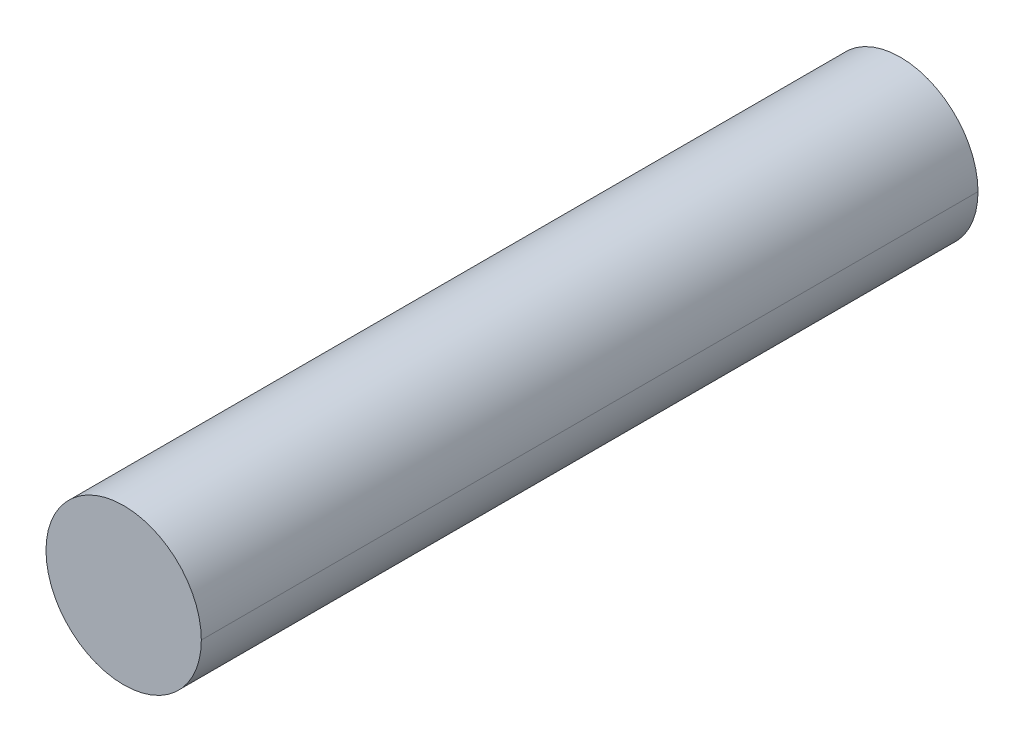
ISO-10303-21;
HEADER;
FILE_DESCRIPTION(('STEP AP214'),'2;1');
FILE_NAME('part.step','',(''),(''),'','','');
FILE_SCHEMA(('AUTOMOTIVE_DESIGN { 1 0 10303 214 1 1 1 1 }'));
ENDSEC;
DATA;
#1=APPLICATION_CONTEXT('core data for automotive mechanical design processes');
#2=APPLICATION_PROTOCOL_DEFINITION('international standard','automotive_design',2000,#1);
#3=PRODUCT_CONTEXT('',#1,'mechanical');
#4=PRODUCT('Part','Part','',(#3));
#5=PRODUCT_RELATED_PRODUCT_CATEGORY('part','',(#4));
#6=PRODUCT_DEFINITION_FORMATION('','',#4);
#7=PRODUCT_DEFINITION_CONTEXT('part definition',#1,'design');
#8=PRODUCT_DEFINITION('design','',#6,#7);
#9=PRODUCT_DEFINITION_SHAPE('','',#8);
#10=(LENGTH_UNIT() NAMED_UNIT(*) SI_UNIT(.MILLI.,.METRE.));
#11=(NAMED_UNIT(*) PLANE_ANGLE_UNIT() SI_UNIT($,.RADIAN.));
#12=(NAMED_UNIT(*) SI_UNIT($,.STERADIAN.) SOLID_ANGLE_UNIT());
#13=UNCERTAINTY_MEASURE_WITH_UNIT(LENGTH_MEASURE(1.E-05),#10,'distance_accuracy_value','');
#14=(GEOMETRIC_REPRESENTATION_CONTEXT(3) GLOBAL_UNCERTAINTY_ASSIGNED_CONTEXT((#13)) GLOBAL_UNIT_ASSIGNED_CONTEXT((#10,
#11,#12)) REPRESENTATION_CONTEXT('',''));
#15=CARTESIAN_POINT('',(0.,0.,0.));
#16=DIRECTION('',(0.,0.,1.));
#17=DIRECTION('',(1.,0.,0.));
#18=AXIS2_PLACEMENT_3D('',#15,#16,#17);
#19=CARTESIAN_POINT('',(0.,0.,0.));
#20=DIRECTION('',(0.,0.,1.));
#21=DIRECTION('',(1.,0.,0.));
#22=AXIS2_PLACEMENT_3D('',#19,#20,#21);
#23=PLANE('',#22);
#24=CARTESIAN_POINT('',(0.,0.,0.));
#25=DIRECTION('',(0.,0.,1.));
#26=DIRECTION('',(1.,0.,0.));
#27=AXIS2_PLACEMENT_3D('',#24,#25,#26);
#28=CIRCLE('',#27,5.);
#29=CARTESIAN_POINT('',(-5.,0.,0.));
#30=VERTEX_POINT('',#29);
#31=CARTESIAN_POINT('',(5.,0.,0.));
#32=VERTEX_POINT('',#31);
#33=EDGE_CURVE('E9',#30,#32,#28,.T.);
#34=ORIENTED_EDGE('',*,*,#33,.F.);
#35=CARTESIAN_POINT('',(0.,0.,0.));
#36=DIRECTION('',(0.,0.,1.));
#37=DIRECTION('',(1.,0.,0.));
#38=AXIS2_PLACEMENT_3D('',#35,#36,#37);
#39=CIRCLE('',#38,5.);
#40=EDGE_CURVE('E65',#32,#30,#39,.T.);
#41=ORIENTED_EDGE('',*,*,#40,.F.);
#42=EDGE_LOOP('',(#34,#41));
#43=FACE_BOUND('',#42,.T.);
#44=ADVANCED_FACE('F14',(#43),#23,.F.);
#45=CARTESIAN_POINT('',(0.,0.,50.));
#46=DIRECTION('',(0.,0.,1.));
#47=DIRECTION('',(1.,0.,0.));
#48=AXIS2_PLACEMENT_3D('',#45,#46,#47);
#49=PLANE('',#48);
#50=CARTESIAN_POINT('',(0.,0.,50.));
#51=DIRECTION('',(0.,0.,1.));
#52=DIRECTION('',(1.,0.,0.));
#53=AXIS2_PLACEMENT_3D('',#50,#51,#52);
#54=CIRCLE('',#53,5.);
#55=CARTESIAN_POINT('',(-5.,0.,50.));
#56=VERTEX_POINT('',#55);
#57=CARTESIAN_POINT('',(5.,0.,50.));
#58=VERTEX_POINT('',#57);
#59=EDGE_CURVE('E25',#56,#58,#54,.T.);
#60=ORIENTED_EDGE('',*,*,#59,.T.);
#61=CARTESIAN_POINT('',(0.,0.,50.));
#62=DIRECTION('',(0.,0.,1.));
#63=DIRECTION('',(1.,0.,0.));
#64=AXIS2_PLACEMENT_3D('',#61,#62,#63);
#65=CIRCLE('',#64,5.);
#66=EDGE_CURVE('E18',#58,#56,#65,.T.);
#67=ORIENTED_EDGE('',*,*,#66,.T.);
#68=EDGE_LOOP('',(#60,#67));
#69=FACE_BOUND('',#68,.T.);
#70=ADVANCED_FACE('F16',(#69),#49,.T.);
#71=CARTESIAN_POINT('',(0.,0.,50.));
#72=DIRECTION('',(0.,0.,-1.));
#73=DIRECTION('',(-1.,0.,0.));
#74=AXIS2_PLACEMENT_3D('',#71,#72,#73);
#75=CYLINDRICAL_SURFACE('',#74,5.);
#76=DIRECTION('',(0.,0.,-1.));
#77=VECTOR('',#76,1.);
#78=CARTESIAN_POINT('',(5.,0.,50.));
#79=LINE('',#78,#77);
#80=EDGE_CURVE('E60',#58,#32,#79,.T.);
#81=ORIENTED_EDGE('',*,*,#80,.F.);
#82=ORIENTED_EDGE('',*,*,#59,.F.);
#83=DIRECTION('',(0.,0.,-1.));
#84=VECTOR('',#83,1.);
#85=CARTESIAN_POINT('',(-5.,0.,50.));
#86=LINE('',#85,#84);
#87=EDGE_CURVE('E57',#56,#30,#86,.T.);
#88=ORIENTED_EDGE('',*,*,#87,.T.);
#89=ORIENTED_EDGE('',*,*,#33,.T.);
#90=EDGE_LOOP('',(#81,#82,#88,#89));
#91=FACE_BOUND('',#90,.T.);
#92=ADVANCED_FACE('F61',(#91),#75,.T.);
#93=CARTESIAN_POINT('',(0.,0.,50.));
#94=DIRECTION('',(0.,0.,-1.));
#95=DIRECTION('',(-1.,0.,0.));
#96=AXIS2_PLACEMENT_3D('',#93,#94,#95);
#97=CYLINDRICAL_SURFACE('',#96,5.);
#98=ORIENTED_EDGE('',*,*,#66,.F.);
#99=ORIENTED_EDGE('',*,*,#80,.T.);
#100=ORIENTED_EDGE('',*,*,#40,.T.);
#101=ORIENTED_EDGE('',*,*,#87,.F.);
#102=EDGE_LOOP('',(#98,#99,#100,#101));
#103=FACE_BOUND('',#102,.T.);
#104=ADVANCED_FACE('F67',(#103),#97,.T.);
#105=CLOSED_SHELL('',(#44,#70,#92,#104));
#106=MANIFOLD_SOLID_BREP('B1',#105);
#107=ADVANCED_BREP_SHAPE_REPRESENTATION('',(#18,#106),#14);
#108=SHAPE_DEFINITION_REPRESENTATION(#9,#107);
ENDSEC;
END-ISO-10303-21;
